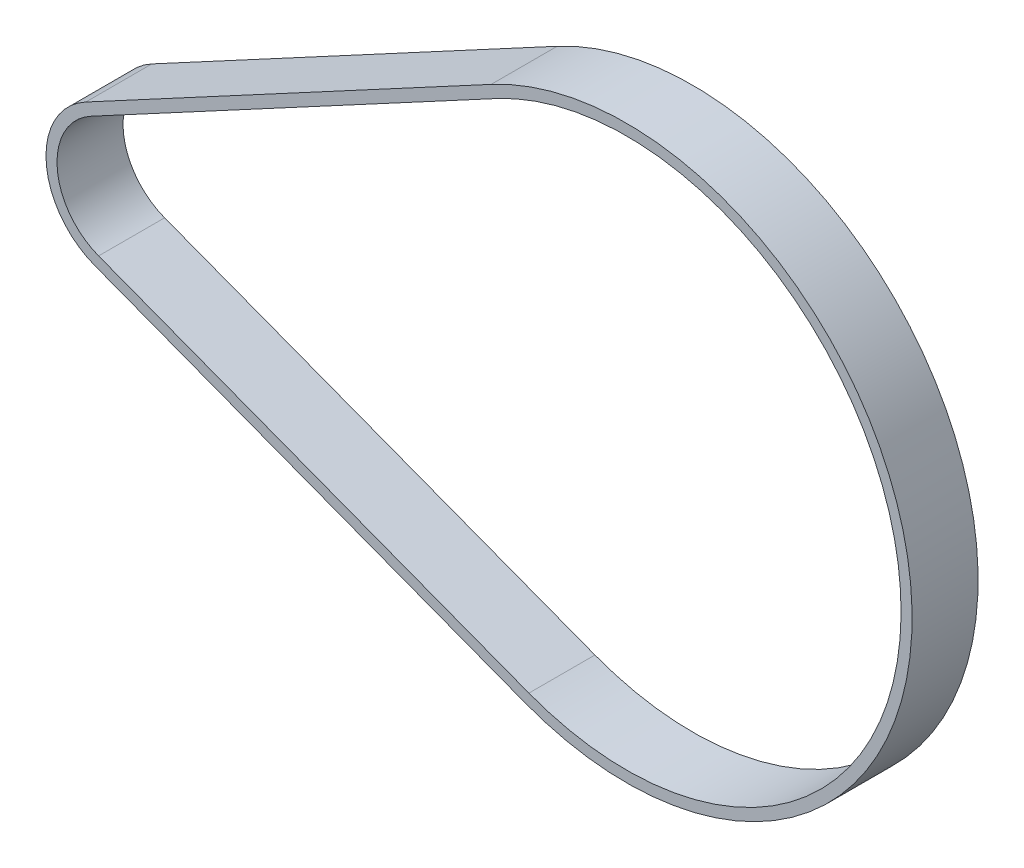
ISO-10303-21;
HEADER;
FILE_DESCRIPTION(('STEP AP214'),'2;1');
FILE_NAME('part.step','',(''),(''),'','','');
FILE_SCHEMA(('AUTOMOTIVE_DESIGN { 1 0 10303 214 1 1 1 1 }'));
ENDSEC;
DATA;
#1=APPLICATION_CONTEXT('core data for automotive mechanical design processes');
#2=APPLICATION_PROTOCOL_DEFINITION('international standard','automotive_design',2000,#1);
#3=PRODUCT_CONTEXT('',#1,'mechanical');
#4=PRODUCT('Part','Part','',(#3));
#5=PRODUCT_RELATED_PRODUCT_CATEGORY('part','',(#4));
#6=PRODUCT_DEFINITION_FORMATION('','',#4);
#7=PRODUCT_DEFINITION_CONTEXT('part definition',#1,'design');
#8=PRODUCT_DEFINITION('design','',#6,#7);
#9=PRODUCT_DEFINITION_SHAPE('','',#8);
#10=(LENGTH_UNIT() NAMED_UNIT(*) SI_UNIT(.MILLI.,.METRE.));
#11=(NAMED_UNIT(*) PLANE_ANGLE_UNIT() SI_UNIT($,.RADIAN.));
#12=(NAMED_UNIT(*) SI_UNIT($,.STERADIAN.) SOLID_ANGLE_UNIT());
#13=UNCERTAINTY_MEASURE_WITH_UNIT(LENGTH_MEASURE(1.E-05),#10,'distance_accuracy_value','');
#14=(GEOMETRIC_REPRESENTATION_CONTEXT(3) GLOBAL_UNCERTAINTY_ASSIGNED_CONTEXT((#13)) GLOBAL_UNIT_ASSIGNED_CONTEXT((#10,
#11,#12)) REPRESENTATION_CONTEXT('',''));
#15=CARTESIAN_POINT('',(0.,0.,0.));
#16=DIRECTION('',(0.,0.,1.));
#17=DIRECTION('',(1.,0.,0.));
#18=AXIS2_PLACEMENT_3D('',#15,#16,#17);
#19=CARTESIAN_POINT('',(45.9924825284277,-0.504799999999965,-7.5));
#20=DIRECTION('',(0.,0.,1.));
#21=DIRECTION('',(1.,0.,0.));
#22=AXIS2_PLACEMENT_3D('',#19,#20,#21);
#23=CYLINDRICAL_SURFACE('',#22,25.965);
#24=CARTESIAN_POINT('',(45.9924825284277,-0.504799999999965,-1.5));
#25=DIRECTION('',(0.,0.,-1.));
#26=DIRECTION('',(-1.,0.,0.));
#27=AXIS2_PLACEMENT_3D('',#24,#25,#26);
#28=CIRCLE('',#27,25.965);
#29=CARTESIAN_POINT('',(36.771000526899,-24.7771195161789,-1.5));
#30=VERTEX_POINT('',#29);
#31=CARTESIAN_POINT('',(33.69546465619,22.3636187570953,-1.5));
#32=VERTEX_POINT('',#31);
#33=EDGE_CURVE('E157',#30,#32,#28,.F.);
#34=ORIENTED_EDGE('',*,*,#33,.F.);
#35=DIRECTION('',(0.,0.,1.));
#36=VECTOR('',#35,1.);
#37=CARTESIAN_POINT('',(36.771000526899,-24.7771195161789,-7.5));
#38=LINE('',#37,#36);
#39=CARTESIAN_POINT('',(36.771000526899,-24.7771195161789,-7.5));
#40=VERTEX_POINT('',#39);
#41=EDGE_CURVE('E12',#40,#30,#38,.T.);
#42=ORIENTED_EDGE('',*,*,#41,.F.);
#43=CARTESIAN_POINT('',(45.9924825284277,-0.504799999999965,-7.5));
#44=DIRECTION('',(0.,0.,-1.));
#45=DIRECTION('',(-1.,0.,0.));
#46=AXIS2_PLACEMENT_3D('',#43,#44,#45);
#47=CIRCLE('',#46,25.965);
#48=CARTESIAN_POINT('',(33.69546465619,22.3636187570953,-7.5));
#49=VERTEX_POINT('',#48);
#50=EDGE_CURVE('E161',#40,#49,#47,.F.);
#51=ORIENTED_EDGE('',*,*,#50,.T.);
#52=DIRECTION('',(0.,0.,1.));
#53=VECTOR('',#52,1.);
#54=CARTESIAN_POINT('',(33.69546465619,22.3636187570953,-7.5));
#55=LINE('',#54,#53);
#56=EDGE_CURVE('E62',#49,#32,#55,.T.);
#57=ORIENTED_EDGE('',*,*,#56,.T.);
#58=EDGE_LOOP('',(#34,#42,#51,#57));
#59=FACE_BOUND('',#58,.T.);
#60=ADVANCED_FACE('F59',(#59),#23,.T.);
#61=CARTESIAN_POINT('',(36.771000526899,-24.7771195161789,-7.5));
#62=DIRECTION('',(-0.355150471847823,-0.934809147551664,0.));
#63=DIRECTION('',(0.934809147551664,-0.355150471847823,0.));
#64=AXIS2_PLACEMENT_3D('',#61,#62,#63);
#65=PLANE('',#64);
#66=DIRECTION('',(0.934809147551664,-0.355150471847823,0.));
#67=VECTOR('',#66,1.);
#68=CARTESIAN_POINT('',(36.771000526899,-24.7771195161789,-1.5));
#69=LINE('',#68,#67);
#70=CARTESIAN_POINT('',(-2.34376296113848,-9.91673144084213,-1.5));
#71=VERTEX_POINT('',#70);
#72=EDGE_CURVE('E165',#71,#30,#69,.T.);
#73=ORIENTED_EDGE('',*,*,#72,.F.);
#74=DIRECTION('',(0.,0.,1.));
#75=VECTOR('',#74,1.);
#76=CARTESIAN_POINT('',(-2.34376296113848,-9.91673144084213,-7.5));
#77=LINE('',#76,#75);
#78=CARTESIAN_POINT('',(-2.34376296113848,-9.91673144084213,-7.5));
#79=VERTEX_POINT('',#78);
#80=EDGE_CURVE('E67',#79,#71,#77,.T.);
#81=ORIENTED_EDGE('',*,*,#80,.F.);
#82=DIRECTION('',(0.934809147551664,-0.355150471847823,0.));
#83=VECTOR('',#82,1.);
#84=CARTESIAN_POINT('',(36.771000526899,-24.7771195161789,-7.5));
#85=LINE('',#84,#83);
#86=EDGE_CURVE('E171',#79,#40,#85,.T.);
#87=ORIENTED_EDGE('',*,*,#86,.T.);
#88=ORIENTED_EDGE('',*,*,#41,.T.);
#89=EDGE_LOOP('',(#73,#81,#87,#88));
#90=FACE_BOUND('',#89,.T.);
#91=ADVANCED_FACE('F197',(#90),#65,.T.);
#92=CARTESIAN_POINT('',(0.0943450280968261,-3.49926664289996,-7.5));
#93=DIRECTION('',(0.,0.,1.));
#94=DIRECTION('',(1.,0.,0.));
#95=AXIS2_PLACEMENT_3D('',#92,#93,#94);
#96=CYLINDRICAL_SURFACE('',#95,6.865);
#97=CARTESIAN_POINT('',(0.0943450280968261,-3.49926664289996,-1.5));
#98=DIRECTION('',(0.,0.,-1.));
#99=DIRECTION('',(-1.,0.,0.));
#100=AXIS2_PLACEMENT_3D('',#97,#98,#99);
#101=CIRCLE('',#100,6.865);
#102=CARTESIAN_POINT('',(-3.15691735175727,2.54701468840984,-1.5));
#103=VERTEX_POINT('',#102);
#104=EDGE_CURVE('E179',#103,#71,#101,.F.);
#105=ORIENTED_EDGE('',*,*,#104,.F.);
#106=DIRECTION('',(0.,0.,1.));
#107=VECTOR('',#106,1.);
#108=CARTESIAN_POINT('',(-3.15691735175727,2.54701468840984,-7.5));
#109=LINE('',#108,#107);
#110=CARTESIAN_POINT('',(-3.15691735175727,2.54701468840984,-7.5));
#111=VERTEX_POINT('',#110);
#112=EDGE_CURVE('E184',#111,#103,#109,.T.);
#113=ORIENTED_EDGE('',*,*,#112,.F.);
#114=CARTESIAN_POINT('',(0.0943450280968261,-3.49926664289996,-7.5));
#115=DIRECTION('',(0.,0.,-1.));
#116=DIRECTION('',(-1.,0.,0.));
#117=AXIS2_PLACEMENT_3D('',#114,#115,#116);
#118=CIRCLE('',#117,6.865);
#119=EDGE_CURVE('E168',#111,#79,#118,.F.);
#120=ORIENTED_EDGE('',*,*,#119,.T.);
#121=ORIENTED_EDGE('',*,*,#80,.T.);
#122=EDGE_LOOP('',(#105,#113,#120,#121));
#123=FACE_BOUND('',#122,.T.);
#124=ADVANCED_FACE('F201',(#123),#96,.T.);
#125=CARTESIAN_POINT('',(33.69546465619,22.3636187570953,-7.5));
#126=DIRECTION('',(-0.47359976399914,0.880740179360496,0.));
#127=DIRECTION('',(-0.880740179360496,-0.47359976399914,0.));
#128=AXIS2_PLACEMENT_3D('',#125,#126,#127);
#129=PLANE('',#128);
#130=DIRECTION('',(-0.880740179360496,-0.47359976399914,0.));
#131=VECTOR('',#130,1.);
#132=CARTESIAN_POINT('',(33.69546465619,22.3636187570953,-1.5));
#133=LINE('',#132,#131);
#134=EDGE_CURVE('E176',#32,#103,#133,.T.);
#135=ORIENTED_EDGE('',*,*,#134,.F.);
#136=ORIENTED_EDGE('',*,*,#56,.F.);
#137=DIRECTION('',(-0.880740179360496,-0.47359976399914,0.));
#138=VECTOR('',#137,1.);
#139=CARTESIAN_POINT('',(33.69546465619,22.3636187570953,-7.5));
#140=LINE('',#139,#138);
#141=EDGE_CURVE('E164',#49,#111,#140,.T.);
#142=ORIENTED_EDGE('',*,*,#141,.T.);
#143=ORIENTED_EDGE('',*,*,#112,.T.);
#144=EDGE_LOOP('',(#135,#136,#142,#143));
#145=FACE_BOUND('',#144,.T.);
#146=ADVANCED_FACE('F192',(#145),#129,.T.);
#147=CARTESIAN_POINT('',(45.9924825284277,-0.504799999999965,-7.5));
#148=DIRECTION('',(0.,0.,-1.));
#149=DIRECTION('',(-1.,0.,0.));
#150=AXIS2_PLACEMENT_3D('',#147,#148,#149);
#151=PLANE('',#150);
#152=CARTESIAN_POINT('',(45.9924825284277,-0.504799999999965,-7.5));
#153=DIRECTION('',(0.,0.,-1.));
#154=DIRECTION('',(-1.,0.,0.));
#155=AXIS2_PLACEMENT_3D('',#152,#153,#154);
#156=CIRCLE('',#155,24.965);
#157=CARTESIAN_POINT('',(37.1261509987468,-23.8423103686273,-7.5));
#158=VERTEX_POINT('',#157);
#159=CARTESIAN_POINT('',(34.1690644201891,21.4828785777348,-7.5));
#160=VERTEX_POINT('',#159);
#161=EDGE_CURVE('E126',#158,#160,#156,.F.);
#162=ORIENTED_EDGE('',*,*,#161,.T.);
#163=DIRECTION('',(-0.880740179360496,-0.47359976399914,0.));
#164=VECTOR('',#163,1.);
#165=CARTESIAN_POINT('',(34.1690644201892,21.4828785777348,-7.5));
#166=LINE('',#165,#164);
#167=CARTESIAN_POINT('',(-2.68331758775813,1.66627450904935,-7.5));
#168=VERTEX_POINT('',#167);
#169=EDGE_CURVE('E135',#160,#168,#166,.T.);
#170=ORIENTED_EDGE('',*,*,#169,.T.);
#171=CARTESIAN_POINT('',(0.0943450280968261,-3.49926664289996,-7.5));
#172=DIRECTION('',(0.,0.,-1.));
#173=DIRECTION('',(-1.,0.,0.));
#174=AXIS2_PLACEMENT_3D('',#171,#172,#173);
#175=CIRCLE('',#174,5.865);
#176=CARTESIAN_POINT('',(-1.98861248929066,-8.98192229329047,-7.5));
#177=VERTEX_POINT('',#176);
#178=EDGE_CURVE('E75',#168,#177,#175,.F.);
#179=ORIENTED_EDGE('',*,*,#178,.T.);
#180=DIRECTION('',(0.934809147551664,-0.355150471847823,0.));
#181=VECTOR('',#180,1.);
#182=CARTESIAN_POINT('',(37.1261509987468,-23.8423103686273,-7.5));
#183=LINE('',#182,#181);
#184=EDGE_CURVE('E132',#177,#158,#183,.T.);
#185=ORIENTED_EDGE('',*,*,#184,.T.);
#186=EDGE_LOOP('',(#162,#170,#179,#185));
#187=FACE_BOUND('',#186,.T.);
#188=ORIENTED_EDGE('',*,*,#50,.F.);
#189=ORIENTED_EDGE('',*,*,#86,.F.);
#190=ORIENTED_EDGE('',*,*,#119,.F.);
#191=ORIENTED_EDGE('',*,*,#141,.F.);
#192=EDGE_LOOP('',(#188,#189,#190,#191));
#193=FACE_BOUND('',#192,.T.);
#194=ADVANCED_FACE('F139',(#187,#193),#151,.T.);
#195=CARTESIAN_POINT('',(45.9924825284277,-0.504799999999965,-1.5));
#196=DIRECTION('',(0.,0.,-1.));
#197=DIRECTION('',(-1.,0.,0.));
#198=AXIS2_PLACEMENT_3D('',#195,#196,#197);
#199=PLANE('',#198);
#200=DIRECTION('',(-0.880740179360496,-0.47359976399914,0.));
#201=VECTOR('',#200,1.);
#202=CARTESIAN_POINT('',(34.1690644201892,21.4828785777348,-1.5));
#203=LINE('',#202,#201);
#204=CARTESIAN_POINT('',(34.1690644201891,21.4828785777348,-1.5));
#205=VERTEX_POINT('',#204);
#206=CARTESIAN_POINT('',(-2.68331758775813,1.66627450904935,-1.5));
#207=VERTEX_POINT('',#206);
#208=EDGE_CURVE('E151',#205,#207,#203,.T.);
#209=ORIENTED_EDGE('',*,*,#208,.F.);
#210=CARTESIAN_POINT('',(45.9924825284277,-0.504799999999965,-1.5));
#211=DIRECTION('',(0.,0.,-1.));
#212=DIRECTION('',(-1.,0.,0.));
#213=AXIS2_PLACEMENT_3D('',#210,#211,#212);
#214=CIRCLE('',#213,24.965);
#215=CARTESIAN_POINT('',(37.1261509987468,-23.8423103686273,-1.5));
#216=VERTEX_POINT('',#215);
#217=EDGE_CURVE('E83',#216,#205,#214,.F.);
#218=ORIENTED_EDGE('',*,*,#217,.F.);
#219=DIRECTION('',(0.934809147551664,-0.355150471847823,0.));
#220=VECTOR('',#219,1.);
#221=CARTESIAN_POINT('',(37.1261509987468,-23.8423103686273,-1.5));
#222=LINE('',#221,#220);
#223=CARTESIAN_POINT('',(-1.98861248929066,-8.98192229329047,-1.5));
#224=VERTEX_POINT('',#223);
#225=EDGE_CURVE('E142',#224,#216,#222,.T.);
#226=ORIENTED_EDGE('',*,*,#225,.F.);
#227=CARTESIAN_POINT('',(0.0943450280968261,-3.49926664289996,-1.5));
#228=DIRECTION('',(0.,0.,-1.));
#229=DIRECTION('',(-1.,0.,0.));
#230=AXIS2_PLACEMENT_3D('',#227,#228,#229);
#231=CIRCLE('',#230,5.865);
#232=EDGE_CURVE('E145',#207,#224,#231,.F.);
#233=ORIENTED_EDGE('',*,*,#232,.F.);
#234=EDGE_LOOP('',(#209,#218,#226,#233));
#235=FACE_BOUND('',#234,.T.);
#236=ORIENTED_EDGE('',*,*,#33,.T.);
#237=ORIENTED_EDGE('',*,*,#134,.T.);
#238=ORIENTED_EDGE('',*,*,#104,.T.);
#239=ORIENTED_EDGE('',*,*,#72,.T.);
#240=EDGE_LOOP('',(#236,#237,#238,#239));
#241=FACE_BOUND('',#240,.T.);
#242=ADVANCED_FACE('F194',(#235,#241),#199,.F.);
#243=CARTESIAN_POINT('',(45.9924825284277,-0.504799999999965,-7.5));
#244=DIRECTION('',(0.,0.,1.));
#245=DIRECTION('',(1.,0.,0.));
#246=AXIS2_PLACEMENT_3D('',#243,#244,#245);
#247=CYLINDRICAL_SURFACE('',#246,24.965);
#248=ORIENTED_EDGE('',*,*,#217,.T.);
#249=DIRECTION('',(0.,0.,1.));
#250=VECTOR('',#249,1.);
#251=CARTESIAN_POINT('',(34.1690644201891,21.4828785777348,-7.5));
#252=LINE('',#251,#250);
#253=EDGE_CURVE('E122',#160,#205,#252,.T.);
#254=ORIENTED_EDGE('',*,*,#253,.F.);
#255=ORIENTED_EDGE('',*,*,#161,.F.);
#256=DIRECTION('',(0.,0.,1.));
#257=VECTOR('',#256,1.);
#258=CARTESIAN_POINT('',(37.1261509987468,-23.8423103686273,-7.5));
#259=LINE('',#258,#257);
#260=EDGE_CURVE('E155',#158,#216,#259,.T.);
#261=ORIENTED_EDGE('',*,*,#260,.T.);
#262=EDGE_LOOP('',(#248,#254,#255,#261));
#263=FACE_BOUND('',#262,.T.);
#264=ADVANCED_FACE('F124',(#263),#247,.F.);
#265=CARTESIAN_POINT('',(37.1261509987468,-23.8423103686273,-7.5));
#266=DIRECTION('',(-0.355150471847823,-0.934809147551664,0.));
#267=DIRECTION('',(0.934809147551664,-0.355150471847823,0.));
#268=AXIS2_PLACEMENT_3D('',#265,#266,#267);
#269=PLANE('',#268);
#270=ORIENTED_EDGE('',*,*,#225,.T.);
#271=ORIENTED_EDGE('',*,*,#260,.F.);
#272=ORIENTED_EDGE('',*,*,#184,.F.);
#273=DIRECTION('',(0.,0.,1.));
#274=VECTOR('',#273,1.);
#275=CARTESIAN_POINT('',(-1.98861248929066,-8.98192229329047,-7.5));
#276=LINE('',#275,#274);
#277=EDGE_CURVE('E158',#177,#224,#276,.T.);
#278=ORIENTED_EDGE('',*,*,#277,.T.);
#279=EDGE_LOOP('',(#270,#271,#272,#278));
#280=FACE_BOUND('',#279,.T.);
#281=ADVANCED_FACE('F252',(#280),#269,.F.);
#282=CARTESIAN_POINT('',(0.0943450280968261,-3.49926664289996,-7.5));
#283=DIRECTION('',(0.,0.,1.));
#284=DIRECTION('',(1.,0.,0.));
#285=AXIS2_PLACEMENT_3D('',#282,#283,#284);
#286=CYLINDRICAL_SURFACE('',#285,5.865);
#287=ORIENTED_EDGE('',*,*,#232,.T.);
#288=ORIENTED_EDGE('',*,*,#277,.F.);
#289=ORIENTED_EDGE('',*,*,#178,.F.);
#290=DIRECTION('',(0.,0.,1.));
#291=VECTOR('',#290,1.);
#292=CARTESIAN_POINT('',(-2.68331758775813,1.66627450904935,-7.5));
#293=LINE('',#292,#291);
#294=EDGE_CURVE('E131',#168,#207,#293,.T.);
#295=ORIENTED_EDGE('',*,*,#294,.T.);
#296=EDGE_LOOP('',(#287,#288,#289,#295));
#297=FACE_BOUND('',#296,.T.);
#298=ADVANCED_FACE('F261',(#297),#286,.F.);
#299=CARTESIAN_POINT('',(34.1690644201892,21.4828785777348,-7.5));
#300=DIRECTION('',(-0.47359976399914,0.880740179360496,0.));
#301=DIRECTION('',(-0.880740179360496,-0.47359976399914,0.));
#302=AXIS2_PLACEMENT_3D('',#299,#300,#301);
#303=PLANE('',#302);
#304=ORIENTED_EDGE('',*,*,#208,.T.);
#305=ORIENTED_EDGE('',*,*,#294,.F.);
#306=ORIENTED_EDGE('',*,*,#169,.F.);
#307=ORIENTED_EDGE('',*,*,#253,.T.);
#308=EDGE_LOOP('',(#304,#305,#306,#307));
#309=FACE_BOUND('',#308,.T.);
#310=ADVANCED_FACE('F136',(#309),#303,.F.);
#311=CLOSED_SHELL('',(#60,#91,#124,#146,#194,#242,#264,#281,#298,#310));
#312=MANIFOLD_SOLID_BREP('B2',#311);
#313=ADVANCED_BREP_SHAPE_REPRESENTATION('',(#18,#312),#14);
#314=SHAPE_DEFINITION_REPRESENTATION(#9,#313);
ENDSEC;
END-ISO-10303-21;
